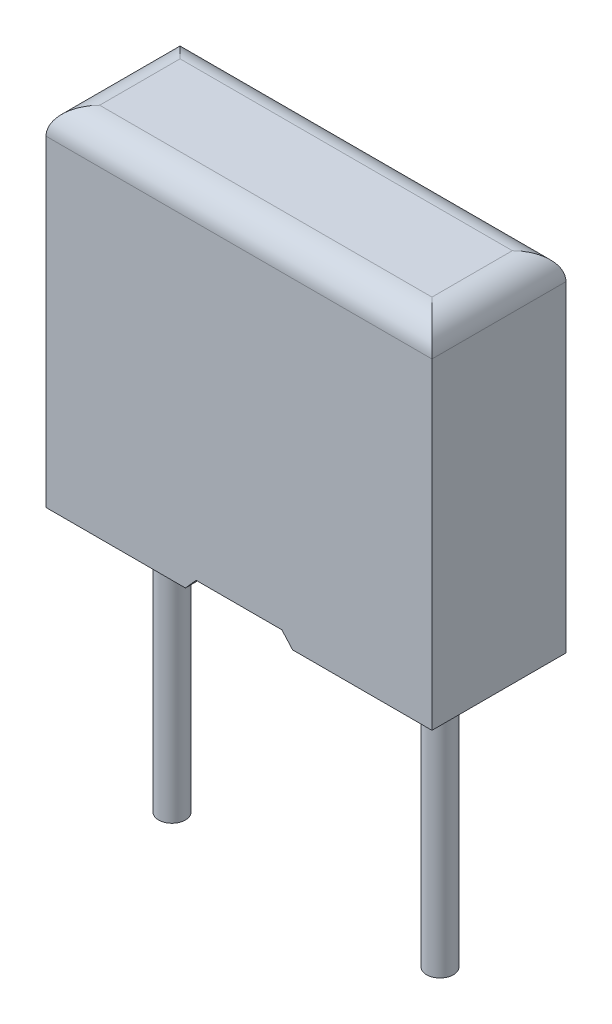
ISO-10303-21;
HEADER;
FILE_DESCRIPTION(('STEP AP214'),'2;1');
FILE_NAME('part.step','',(''),(''),'','','');
FILE_SCHEMA(('AUTOMOTIVE_DESIGN { 1 0 10303 214 1 1 1 1 }'));
ENDSEC;
DATA;
#1=APPLICATION_CONTEXT('core data for automotive mechanical design processes');
#2=APPLICATION_PROTOCOL_DEFINITION('international standard','automotive_design',2000,#1);
#3=PRODUCT_CONTEXT('',#1,'mechanical');
#4=PRODUCT('Part','Part','',(#3));
#5=PRODUCT_RELATED_PRODUCT_CATEGORY('part','',(#4));
#6=PRODUCT_DEFINITION_FORMATION('','',#4);
#7=PRODUCT_DEFINITION_CONTEXT('part definition',#1,'design');
#8=PRODUCT_DEFINITION('design','',#6,#7);
#9=PRODUCT_DEFINITION_SHAPE('','',#8);
#10=(LENGTH_UNIT() NAMED_UNIT(*) SI_UNIT(.MILLI.,.METRE.));
#11=(NAMED_UNIT(*) PLANE_ANGLE_UNIT() SI_UNIT($,.RADIAN.));
#12=(NAMED_UNIT(*) SI_UNIT($,.STERADIAN.) SOLID_ANGLE_UNIT());
#13=UNCERTAINTY_MEASURE_WITH_UNIT(LENGTH_MEASURE(1.E-05),#10,'distance_accuracy_value','');
#14=(GEOMETRIC_REPRESENTATION_CONTEXT(3) GLOBAL_UNCERTAINTY_ASSIGNED_CONTEXT((#13)) GLOBAL_UNIT_ASSIGNED_CONTEXT((#10,
#11,#12)) REPRESENTATION_CONTEXT('',''));
#15=CARTESIAN_POINT('',(0.,0.,0.));
#16=DIRECTION('',(0.,0.,1.));
#17=DIRECTION('',(1.,0.,0.));
#18=AXIS2_PLACEMENT_3D('',#15,#16,#17);
#19=CARTESIAN_POINT('',(6.1,-5.,1.25));
#20=DIRECTION('',(0.,1.,0.));
#21=DIRECTION('',(0.,0.,1.));
#22=AXIS2_PLACEMENT_3D('',#19,#20,#21);
#23=CYLINDRICAL_SURFACE('',#22,0.25);
#24=CARTESIAN_POINT('',(6.1,-5.,1.25));
#25=DIRECTION('',(0.,1.,0.));
#26=DIRECTION('',(0.,0.,-1.));
#27=AXIS2_PLACEMENT_3D('',#24,#25,#26);
#28=CIRCLE('',#27,0.25);
#29=CARTESIAN_POINT('',(6.1,-5.,1.));
#30=VERTEX_POINT('',#29);
#31=EDGE_CURVE('E11',#30,#30,#28,.T.);
#32=ORIENTED_EDGE('',*,*,#31,.T.);
#33=EDGE_LOOP('',(#32));
#34=FACE_BOUND('',#33,.T.);
#35=CARTESIAN_POINT('',(6.1,0.75,1.25));
#36=DIRECTION('',(0.,-1.,0.));
#37=DIRECTION('',(0.,0.,-1.));
#38=AXIS2_PLACEMENT_3D('',#35,#36,#37);
#39=CIRCLE('',#38,0.25);
#40=CARTESIAN_POINT('',(6.1,0.75,1.5));
#41=VERTEX_POINT('',#40);
#42=EDGE_CURVE('E28',#41,#41,#39,.T.);
#43=ORIENTED_EDGE('',*,*,#42,.T.);
#44=EDGE_LOOP('',(#43));
#45=FACE_BOUND('',#44,.T.);
#46=ADVANCED_FACE('F17',(#34,#45),#23,.T.);
#47=CARTESIAN_POINT('',(1.1,-5.,1.25));
#48=DIRECTION('',(0.,1.,0.));
#49=DIRECTION('',(0.,0.,1.));
#50=AXIS2_PLACEMENT_3D('',#47,#48,#49);
#51=CYLINDRICAL_SURFACE('',#50,0.25);
#52=CARTESIAN_POINT('',(1.1,-5.,1.25));
#53=DIRECTION('',(0.,-1.,0.));
#54=DIRECTION('',(0.,0.,-1.));
#55=AXIS2_PLACEMENT_3D('',#52,#53,#54);
#56=CIRCLE('',#55,0.25);
#57=CARTESIAN_POINT('',(1.1,-5.,1.5));
#58=VERTEX_POINT('',#57);
#59=EDGE_CURVE('E222',#58,#58,#56,.T.);
#60=ORIENTED_EDGE('',*,*,#59,.F.);
#61=EDGE_LOOP('',(#60));
#62=FACE_BOUND('',#61,.T.);
#63=CARTESIAN_POINT('',(1.1,0.75,1.25));
#64=DIRECTION('',(0.,-1.,0.));
#65=DIRECTION('',(0.,0.,-1.));
#66=AXIS2_PLACEMENT_3D('',#63,#64,#65);
#67=CIRCLE('',#66,0.25);
#68=CARTESIAN_POINT('',(1.1,0.75,1.5));
#69=VERTEX_POINT('',#68);
#70=EDGE_CURVE('E356',#69,#69,#67,.T.);
#71=ORIENTED_EDGE('',*,*,#70,.T.);
#72=EDGE_LOOP('',(#71));
#73=FACE_BOUND('',#72,.T.);
#74=ADVANCED_FACE('F881',(#62,#73),#51,.T.);
#75=CARTESIAN_POINT('',(0.,0.,2.5));
#76=DIRECTION('',(0.,1.,0.));
#77=DIRECTION('',(1.,0.,0.));
#78=AXIS2_PLACEMENT_3D('',#75,#76,#77);
#79=PLANE('',#78);
#80=DIRECTION('',(0.,0.,1.));
#81=VECTOR('',#80,1.);
#82=CARTESIAN_POINT('',(4.6,0.,0.));
#83=LINE('',#82,#81);
#84=CARTESIAN_POINT('',(4.6,0.,0.));
#85=VERTEX_POINT('',#84);
#86=CARTESIAN_POINT('',(4.6,0.,0.239999976));
#87=VERTEX_POINT('',#86);
#88=EDGE_CURVE('E208',#85,#87,#83,.T.);
#89=ORIENTED_EDGE('',*,*,#88,.F.);
#90=DIRECTION('',(1.,0.,0.));
#91=VECTOR('',#90,1.);
#92=CARTESIAN_POINT('',(0.,0.,0.));
#93=LINE('',#92,#91);
#94=CARTESIAN_POINT('',(7.2,0.,0.));
#95=VERTEX_POINT('',#94);
#96=EDGE_CURVE('E349',#85,#95,#93,.T.);
#97=ORIENTED_EDGE('',*,*,#96,.T.);
#98=DIRECTION('',(0.,0.,-1.));
#99=VECTOR('',#98,1.);
#100=CARTESIAN_POINT('',(7.2,0.,2.5));
#101=LINE('',#100,#99);
#102=CARTESIAN_POINT('',(7.2,0.,2.5));
#103=VERTEX_POINT('',#102);
#104=EDGE_CURVE('E280',#103,#95,#101,.T.);
#105=ORIENTED_EDGE('',*,*,#104,.F.);
#106=DIRECTION('',(1.,0.,0.));
#107=VECTOR('',#106,1.);
#108=CARTESIAN_POINT('',(0.,0.,2.5));
#109=LINE('',#108,#107);
#110=CARTESIAN_POINT('',(4.6,0.,2.5));
#111=VERTEX_POINT('',#110);
#112=EDGE_CURVE('E247',#111,#103,#109,.T.);
#113=ORIENTED_EDGE('',*,*,#112,.F.);
#114=DIRECTION('',(0.,0.,1.));
#115=VECTOR('',#114,1.);
#116=CARTESIAN_POINT('',(4.6,0.,0.));
#117=LINE('',#116,#115);
#118=CARTESIAN_POINT('',(4.6,0.,2.260000024));
#119=VERTEX_POINT('',#118);
#120=EDGE_CURVE('E251',#119,#111,#117,.T.);
#121=ORIENTED_EDGE('',*,*,#120,.F.);
#122=DIRECTION('',(-1.,0.,0.));
#123=VECTOR('',#122,1.);
#124=CARTESIAN_POINT('',(6.96000002399999,0.,2.260000024));
#125=LINE('',#124,#123);
#126=CARTESIAN_POINT('',(6.96000002399999,0.,2.260000024));
#127=VERTEX_POINT('',#126);
#128=EDGE_CURVE('E365',#127,#119,#125,.T.);
#129=ORIENTED_EDGE('',*,*,#128,.F.);
#130=DIRECTION('',(0.,0.,1.));
#131=VECTOR('',#130,1.);
#132=CARTESIAN_POINT('',(6.960000024,0.,0.239999976));
#133=LINE('',#132,#131);
#134=CARTESIAN_POINT('',(6.960000024,0.,0.239999976));
#135=VERTEX_POINT('',#134);
#136=EDGE_CURVE('E175',#135,#127,#133,.T.);
#137=ORIENTED_EDGE('',*,*,#136,.F.);
#138=DIRECTION('',(1.,0.,0.));
#139=VECTOR('',#138,1.);
#140=CARTESIAN_POINT('',(0.239999976,0.,0.239999976000001));
#141=LINE('',#140,#139);
#142=EDGE_CURVE('E266',#87,#135,#141,.T.);
#143=ORIENTED_EDGE('',*,*,#142,.F.);
#144=EDGE_LOOP('',(#89,#97,#105,#113,#121,#129,#137,#143));
#145=FACE_BOUND('',#144,.T.);
#146=ADVANCED_FACE('F434',(#145),#79,.F.);
#147=CARTESIAN_POINT('',(0.,0.,2.5));
#148=DIRECTION('',(0.,0.,-1.));
#149=DIRECTION('',(0.,-1.,0.));
#150=AXIS2_PLACEMENT_3D('',#147,#148,#149);
#151=PLANE('',#150);
#152=DIRECTION('',(0.,1.,0.));
#153=VECTOR('',#152,1.);
#154=CARTESIAN_POINT('',(7.2,0.,2.5));
#155=LINE('',#154,#153);
#156=CARTESIAN_POINT('',(7.2,6.,2.5));
#157=VERTEX_POINT('',#156);
#158=EDGE_CURVE('E357',#103,#157,#155,.T.);
#159=ORIENTED_EDGE('',*,*,#158,.T.);
#160=DIRECTION('',(-1.,0.,0.));
#161=VECTOR('',#160,1.);
#162=CARTESIAN_POINT('',(0.,6.,2.5));
#163=LINE('',#162,#161);
#164=CARTESIAN_POINT('',(0.,6.,2.5));
#165=VERTEX_POINT('',#164);
#166=EDGE_CURVE('E285',#157,#165,#163,.T.);
#167=ORIENTED_EDGE('',*,*,#166,.T.);
#168=DIRECTION('',(0.,-1.,0.));
#169=VECTOR('',#168,1.);
#170=CARTESIAN_POINT('',(0.,0.,2.5));
#171=LINE('',#170,#169);
#172=CARTESIAN_POINT('',(0.,0.,2.5));
#173=VERTEX_POINT('',#172);
#174=EDGE_CURVE('E281',#165,#173,#171,.T.);
#175=ORIENTED_EDGE('',*,*,#174,.T.);
#176=DIRECTION('',(1.,0.,0.));
#177=VECTOR('',#176,1.);
#178=CARTESIAN_POINT('',(0.,0.,2.5));
#179=LINE('',#178,#177);
#180=CARTESIAN_POINT('',(2.6,0.,2.5));
#181=VERTEX_POINT('',#180);
#182=EDGE_CURVE('E246',#173,#181,#179,.T.);
#183=ORIENTED_EDGE('',*,*,#182,.T.);
#184=DIRECTION('',(-0.665713474524011,-0.746207457639743,0.));
#185=VECTOR('',#184,1.);
#186=CARTESIAN_POINT('',(2.6,0.,2.5));
#187=LINE('',#186,#185);
#188=CARTESIAN_POINT('',(2.799944,0.22412,2.5));
#189=VERTEX_POINT('',#188);
#190=EDGE_CURVE('E275',#189,#181,#187,.T.);
#191=ORIENTED_EDGE('',*,*,#190,.F.);
#192=DIRECTION('',(-1.,0.,0.));
#193=VECTOR('',#192,1.);
#194=CARTESIAN_POINT('',(3.6,0.22412,2.5));
#195=LINE('',#194,#193);
#196=CARTESIAN_POINT('',(4.400056,0.22412,2.5));
#197=VERTEX_POINT('',#196);
#198=EDGE_CURVE('E218',#197,#189,#195,.T.);
#199=ORIENTED_EDGE('',*,*,#198,.F.);
#200=DIRECTION('',(0.665713474524011,-0.746207457639743,0.));
#201=VECTOR('',#200,1.);
#202=CARTESIAN_POINT('',(4.6,0.,2.5));
#203=LINE('',#202,#201);
#204=EDGE_CURVE('E242',#197,#111,#203,.T.);
#205=ORIENTED_EDGE('',*,*,#204,.T.);
#206=ORIENTED_EDGE('',*,*,#112,.T.);
#207=EDGE_LOOP('',(#159,#167,#175,#183,#191,#199,#205,#206));
#208=FACE_BOUND('',#207,.T.);
#209=ADVANCED_FACE('F438',(#208),#151,.F.);
#210=CARTESIAN_POINT('',(0.,0.,0.));
#211=DIRECTION('',(0.,0.,-1.));
#212=DIRECTION('',(0.,-1.,0.));
#213=AXIS2_PLACEMENT_3D('',#210,#211,#212);
#214=PLANE('',#213);
#215=DIRECTION('',(0.,-1.,0.));
#216=VECTOR('',#215,1.);
#217=CARTESIAN_POINT('',(0.,0.,0.));
#218=LINE('',#217,#216);
#219=CARTESIAN_POINT('',(0.,6.,0.));
#220=VERTEX_POINT('',#219);
#221=CARTESIAN_POINT('',(0.,0.,0.));
#222=VERTEX_POINT('',#221);
#223=EDGE_CURVE('E262',#220,#222,#218,.T.);
#224=ORIENTED_EDGE('',*,*,#223,.F.);
#225=DIRECTION('',(1.,0.,0.));
#226=VECTOR('',#225,1.);
#227=CARTESIAN_POINT('',(7.2,6.,0.));
#228=LINE('',#227,#226);
#229=CARTESIAN_POINT('',(7.2,6.,0.));
#230=VERTEX_POINT('',#229);
#231=EDGE_CURVE('E270',#220,#230,#228,.T.);
#232=ORIENTED_EDGE('',*,*,#231,.T.);
#233=DIRECTION('',(0.,1.,0.));
#234=VECTOR('',#233,1.);
#235=CARTESIAN_POINT('',(7.2,0.,0.));
#236=LINE('',#235,#234);
#237=EDGE_CURVE('E364',#95,#230,#236,.T.);
#238=ORIENTED_EDGE('',*,*,#237,.F.);
#239=ORIENTED_EDGE('',*,*,#96,.F.);
#240=DIRECTION('',(0.665713474524011,-0.746207457639743,0.));
#241=VECTOR('',#240,1.);
#242=CARTESIAN_POINT('',(4.6,0.,0.));
#243=LINE('',#242,#241);
#244=CARTESIAN_POINT('',(4.400056,0.22412,0.));
#245=VERTEX_POINT('',#244);
#246=EDGE_CURVE('E211',#245,#85,#243,.T.);
#247=ORIENTED_EDGE('',*,*,#246,.F.);
#248=DIRECTION('',(-1.,0.,0.));
#249=VECTOR('',#248,1.);
#250=CARTESIAN_POINT('',(3.6,0.22412,0.));
#251=LINE('',#250,#249);
#252=CARTESIAN_POINT('',(2.799944,0.22412,0.));
#253=VERTEX_POINT('',#252);
#254=EDGE_CURVE('E227',#245,#253,#251,.T.);
#255=ORIENTED_EDGE('',*,*,#254,.T.);
#256=DIRECTION('',(-0.665713474524011,-0.746207457639743,0.));
#257=VECTOR('',#256,1.);
#258=CARTESIAN_POINT('',(2.6,0.,0.));
#259=LINE('',#258,#257);
#260=CARTESIAN_POINT('',(2.6,0.,0.));
#261=VERTEX_POINT('',#260);
#262=EDGE_CURVE('E223',#253,#261,#259,.T.);
#263=ORIENTED_EDGE('',*,*,#262,.T.);
#264=DIRECTION('',(1.,0.,0.));
#265=VECTOR('',#264,1.);
#266=CARTESIAN_POINT('',(0.,0.,0.));
#267=LINE('',#266,#265);
#268=EDGE_CURVE('E216',#222,#261,#267,.T.);
#269=ORIENTED_EDGE('',*,*,#268,.F.);
#270=EDGE_LOOP('',(#224,#232,#238,#239,#247,#255,#263,#269));
#271=FACE_BOUND('',#270,.T.);
#272=ADVANCED_FACE('F483',(#271),#214,.T.);
#273=CARTESIAN_POINT('',(6.96000002399999,0.75,2.260000024));
#274=DIRECTION('',(0.,0.,1.));
#275=DIRECTION('',(1.,0.,0.));
#276=AXIS2_PLACEMENT_3D('',#273,#274,#275);
#277=PLANE('',#276);
#278=DIRECTION('',(0.665713474524011,-0.746207457639743,0.));
#279=VECTOR('',#278,1.);
#280=CARTESIAN_POINT('',(5.27332139631465,-0.754735282589323,2.260000024));
#281=LINE('',#280,#279);
#282=CARTESIAN_POINT('',(4.400056,0.22412,2.260000024));
#283=VERTEX_POINT('',#282);
#284=EDGE_CURVE('E332',#283,#119,#281,.T.);
#285=ORIENTED_EDGE('',*,*,#284,.F.);
#286=DIRECTION('',(-1.,0.,0.));
#287=VECTOR('',#286,1.);
#288=CARTESIAN_POINT('',(6.96000002399999,0.22412,2.260000024));
#289=LINE('',#288,#287);
#290=CARTESIAN_POINT('',(2.799944,0.22412,2.260000024));
#291=VERTEX_POINT('',#290);
#292=EDGE_CURVE('E228',#283,#291,#289,.T.);
#293=ORIENTED_EDGE('',*,*,#292,.T.);
#294=DIRECTION('',(-0.665713474524011,-0.746207457639743,0.));
#295=VECTOR('',#294,1.);
#296=CARTESIAN_POINT('',(4.90481079565194,2.58349435602724,2.260000024));
#297=LINE('',#296,#295);
#298=CARTESIAN_POINT('',(2.6,0.,2.260000024));
#299=VERTEX_POINT('',#298);
#300=EDGE_CURVE('E21',#291,#299,#297,.T.);
#301=ORIENTED_EDGE('',*,*,#300,.T.);
#302=DIRECTION('',(-1.,0.,0.));
#303=VECTOR('',#302,1.);
#304=CARTESIAN_POINT('',(6.96000002399999,0.,2.260000024));
#305=LINE('',#304,#303);
#306=CARTESIAN_POINT('',(0.239999976,0.,2.260000024));
#307=VERTEX_POINT('',#306);
#308=EDGE_CURVE('E178',#299,#307,#305,.T.);
#309=ORIENTED_EDGE('',*,*,#308,.T.);
#310=DIRECTION('',(0.,-1.,0.));
#311=VECTOR('',#310,1.);
#312=CARTESIAN_POINT('',(0.239999976,0.75,2.260000024));
#313=LINE('',#312,#311);
#314=CARTESIAN_POINT('',(0.239999976,0.75,2.260000024));
#315=VERTEX_POINT('',#314);
#316=EDGE_CURVE('E163',#315,#307,#313,.T.);
#317=ORIENTED_EDGE('',*,*,#316,.F.);
#318=DIRECTION('',(-1.,0.,0.));
#319=VECTOR('',#318,1.);
#320=CARTESIAN_POINT('',(6.96000002399999,0.75,2.260000024));
#321=LINE('',#320,#319);
#322=CARTESIAN_POINT('',(6.96000002399999,0.75,2.260000024));
#323=VERTEX_POINT('',#322);
#324=EDGE_CURVE('E292',#323,#315,#321,.T.);
#325=ORIENTED_EDGE('',*,*,#324,.F.);
#326=DIRECTION('',(0.,-1.,0.));
#327=VECTOR('',#326,1.);
#328=CARTESIAN_POINT('',(6.96000002399999,0.75,2.260000024));
#329=LINE('',#328,#327);
#330=EDGE_CURVE('E185',#323,#127,#329,.T.);
#331=ORIENTED_EDGE('',*,*,#330,.T.);
#332=ORIENTED_EDGE('',*,*,#128,.T.);
#333=EDGE_LOOP('',(#285,#293,#301,#309,#317,#325,#331,#332));
#334=FACE_BOUND('',#333,.T.);
#335=ADVANCED_FACE('F179',(#334),#277,.F.);
#336=CARTESIAN_POINT('',(0.239999976,0.75,0.239999976000001));
#337=DIRECTION('',(0.,0.,-1.));
#338=DIRECTION('',(-1.,0.,0.));
#339=AXIS2_PLACEMENT_3D('',#336,#337,#338);
#340=PLANE('',#339);
#341=DIRECTION('',(1.,0.,0.));
#342=VECTOR('',#341,1.);
#343=CARTESIAN_POINT('',(0.239999976,0.22412,0.239999976000001));
#344=LINE('',#343,#342);
#345=CARTESIAN_POINT('',(2.799944,0.22412,0.239999976));
#346=VERTEX_POINT('',#345);
#347=CARTESIAN_POINT('',(4.400056,0.22412,0.239999976));
#348=VERTEX_POINT('',#347);
#349=EDGE_CURVE('E369',#346,#348,#344,.T.);
#350=ORIENTED_EDGE('',*,*,#349,.T.);
#351=DIRECTION('',(-0.665713474524011,0.746207457639743,0.));
#352=VECTOR('',#351,1.);
#353=CARTESIAN_POINT('',(2.29518920434806,2.58349435602724,0.239999976));
#354=LINE('',#353,#352);
#355=EDGE_CURVE('E248',#87,#348,#354,.T.);
#356=ORIENTED_EDGE('',*,*,#355,.F.);
#357=ORIENTED_EDGE('',*,*,#142,.T.);
#358=DIRECTION('',(0.,-1.,0.));
#359=VECTOR('',#358,1.);
#360=CARTESIAN_POINT('',(6.960000024,0.75,0.239999976));
#361=LINE('',#360,#359);
#362=CARTESIAN_POINT('',(6.960000024,0.75,0.239999976));
#363=VERTEX_POINT('',#362);
#364=EDGE_CURVE('E301',#363,#135,#361,.T.);
#365=ORIENTED_EDGE('',*,*,#364,.F.);
#366=DIRECTION('',(1.,0.,0.));
#367=VECTOR('',#366,1.);
#368=CARTESIAN_POINT('',(0.239999976,0.75,0.239999976000001));
#369=LINE('',#368,#367);
#370=CARTESIAN_POINT('',(0.239999976,0.75,0.239999976000001));
#371=VERTEX_POINT('',#370);
#372=EDGE_CURVE('E252',#371,#363,#369,.T.);
#373=ORIENTED_EDGE('',*,*,#372,.F.);
#374=DIRECTION('',(0.,-1.,0.));
#375=VECTOR('',#374,1.);
#376=CARTESIAN_POINT('',(0.239999976,0.75,0.239999976000001));
#377=LINE('',#376,#375);
#378=CARTESIAN_POINT('',(0.239999976,0.,0.239999976000001));
#379=VERTEX_POINT('',#378);
#380=EDGE_CURVE('E263',#371,#379,#377,.T.);
#381=ORIENTED_EDGE('',*,*,#380,.T.);
#382=DIRECTION('',(1.,0.,0.));
#383=VECTOR('',#382,1.);
#384=CARTESIAN_POINT('',(0.239999976,0.,0.239999976000001));
#385=LINE('',#384,#383);
#386=CARTESIAN_POINT('',(2.6,0.,0.239999976));
#387=VERTEX_POINT('',#386);
#388=EDGE_CURVE('E191',#379,#387,#385,.T.);
#389=ORIENTED_EDGE('',*,*,#388,.T.);
#390=DIRECTION('',(0.665713474524011,0.746207457639743,0.));
#391=VECTOR('',#390,1.);
#392=CARTESIAN_POINT('',(1.92667860368534,-0.754735282589326,0.239999976));
#393=LINE('',#392,#391);
#394=EDGE_CURVE('E288',#387,#346,#393,.T.);
#395=ORIENTED_EDGE('',*,*,#394,.T.);
#396=EDGE_LOOP('',(#350,#356,#357,#365,#373,#381,#389,#395));
#397=FACE_BOUND('',#396,.T.);
#398=ADVANCED_FACE('F453',(#397),#340,.F.);
#399=CARTESIAN_POINT('',(0.,0.75,0.));
#400=DIRECTION('',(0.,-1.,0.));
#401=DIRECTION('',(0.,0.,-1.));
#402=AXIS2_PLACEMENT_3D('',#399,#400,#401);
#403=PLANE('',#402);
#404=DIRECTION('',(0.,0.,-1.));
#405=VECTOR('',#404,1.);
#406=CARTESIAN_POINT('',(0.239999976,0.75,2.260000024));
#407=LINE('',#406,#405);
#408=EDGE_CURVE('E170',#315,#371,#407,.T.);
#409=ORIENTED_EDGE('',*,*,#408,.T.);
#410=ORIENTED_EDGE('',*,*,#372,.T.);
#411=DIRECTION('',(0.,0.,1.));
#412=VECTOR('',#411,1.);
#413=CARTESIAN_POINT('',(6.960000024,0.75,0.239999976));
#414=LINE('',#413,#412);
#415=EDGE_CURVE('E256',#363,#323,#414,.T.);
#416=ORIENTED_EDGE('',*,*,#415,.T.);
#417=ORIENTED_EDGE('',*,*,#324,.T.);
#418=EDGE_LOOP('',(#409,#410,#416,#417));
#419=FACE_BOUND('',#418,.T.);
#420=ORIENTED_EDGE('',*,*,#42,.F.);
#421=EDGE_LOOP('',(#420));
#422=FACE_BOUND('',#421,.T.);
#423=ORIENTED_EDGE('',*,*,#70,.F.);
#424=EDGE_LOOP('',(#423));
#425=FACE_BOUND('',#424,.T.);
#426=ADVANCED_FACE('F455',(#419,#422,#425),#403,.T.);
#427=CARTESIAN_POINT('',(0.,0.,2.5));
#428=DIRECTION('',(0.,1.,0.));
#429=DIRECTION('',(1.,0.,0.));
#430=AXIS2_PLACEMENT_3D('',#427,#428,#429);
#431=PLANE('',#430);
#432=ORIENTED_EDGE('',*,*,#268,.T.);
#433=DIRECTION('',(0.,0.,1.));
#434=VECTOR('',#433,1.);
#435=CARTESIAN_POINT('',(2.6,0.,0.));
#436=LINE('',#435,#434);
#437=EDGE_CURVE('E213',#261,#387,#436,.T.);
#438=ORIENTED_EDGE('',*,*,#437,.T.);
#439=ORIENTED_EDGE('',*,*,#388,.F.);
#440=DIRECTION('',(0.,0.,-1.));
#441=VECTOR('',#440,1.);
#442=CARTESIAN_POINT('',(0.239999976,0.,2.260000024));
#443=LINE('',#442,#441);
#444=EDGE_CURVE('E168',#307,#379,#443,.T.);
#445=ORIENTED_EDGE('',*,*,#444,.F.);
#446=ORIENTED_EDGE('',*,*,#308,.F.);
#447=DIRECTION('',(0.,0.,1.));
#448=VECTOR('',#447,1.);
#449=CARTESIAN_POINT('',(2.6,0.,0.));
#450=LINE('',#449,#448);
#451=EDGE_CURVE('E217',#299,#181,#450,.T.);
#452=ORIENTED_EDGE('',*,*,#451,.T.);
#453=ORIENTED_EDGE('',*,*,#182,.F.);
#454=DIRECTION('',(0.,0.,-1.));
#455=VECTOR('',#454,1.);
#456=CARTESIAN_POINT('',(0.,0.,2.5));
#457=LINE('',#456,#455);
#458=EDGE_CURVE('E261',#173,#222,#457,.T.);
#459=ORIENTED_EDGE('',*,*,#458,.T.);
#460=EDGE_LOOP('',(#432,#438,#439,#445,#446,#452,#453,#459));
#461=FACE_BOUND('',#460,.T.);
#462=ADVANCED_FACE('F188',(#461),#431,.F.);
#463=CARTESIAN_POINT('',(0.,0.,2.5));
#464=DIRECTION('',(1.,0.,0.));
#465=DIRECTION('',(0.,1.,0.));
#466=AXIS2_PLACEMENT_3D('',#463,#464,#465);
#467=PLANE('',#466);
#468=ORIENTED_EDGE('',*,*,#174,.F.);
#469=DIRECTION('',(0.,0.,-1.));
#470=VECTOR('',#469,1.);
#471=CARTESIAN_POINT('',(0.,6.,2.5));
#472=LINE('',#471,#470);
#473=EDGE_CURVE('E257',#165,#220,#472,.T.);
#474=ORIENTED_EDGE('',*,*,#473,.T.);
#475=ORIENTED_EDGE('',*,*,#223,.T.);
#476=ORIENTED_EDGE('',*,*,#458,.F.);
#477=EDGE_LOOP('',(#468,#474,#475,#476));
#478=FACE_BOUND('',#477,.T.);
#479=ADVANCED_FACE('F501',(#478),#467,.F.);
#480=CARTESIAN_POINT('',(7.2,0.,2.5));
#481=DIRECTION('',(-1.,0.,0.));
#482=DIRECTION('',(0.,0.,1.));
#483=AXIS2_PLACEMENT_3D('',#480,#481,#482);
#484=PLANE('',#483);
#485=ORIENTED_EDGE('',*,*,#237,.T.);
#486=DIRECTION('',(0.,0.,1.));
#487=VECTOR('',#486,1.);
#488=CARTESIAN_POINT('',(7.2,6.,2.5));
#489=LINE('',#488,#487);
#490=EDGE_CURVE('E314',#230,#157,#489,.T.);
#491=ORIENTED_EDGE('',*,*,#490,.T.);
#492=ORIENTED_EDGE('',*,*,#158,.F.);
#493=ORIENTED_EDGE('',*,*,#104,.T.);
#494=EDGE_LOOP('',(#485,#491,#492,#493));
#495=FACE_BOUND('',#494,.T.);
#496=ADVANCED_FACE('F487',(#495),#484,.F.);
#497=CARTESIAN_POINT('',(0.,6.5,2.5));
#498=DIRECTION('',(0.,-1.,0.));
#499=DIRECTION('',(0.,0.,-1.));
#500=AXIS2_PLACEMENT_3D('',#497,#498,#499);
#501=PLANE('',#500);
#502=DIRECTION('',(-1.,0.,0.));
#503=VECTOR('',#502,1.);
#504=CARTESIAN_POINT('',(0.,6.5,0.5));
#505=LINE('',#504,#503);
#506=CARTESIAN_POINT('',(6.7,6.5,0.5));
#507=VERTEX_POINT('',#506);
#508=CARTESIAN_POINT('',(0.5,6.5,0.5));
#509=VERTEX_POINT('',#508);
#510=EDGE_CURVE('E276',#507,#509,#505,.T.);
#511=ORIENTED_EDGE('',*,*,#510,.T.);
#512=DIRECTION('',(0.,0.,1.));
#513=VECTOR('',#512,1.);
#514=CARTESIAN_POINT('',(0.5,6.5,2.5));
#515=LINE('',#514,#513);
#516=CARTESIAN_POINT('',(0.5,6.5,2.));
#517=VERTEX_POINT('',#516);
#518=EDGE_CURVE('E241',#509,#517,#515,.T.);
#519=ORIENTED_EDGE('',*,*,#518,.T.);
#520=DIRECTION('',(1.,0.,0.));
#521=VECTOR('',#520,1.);
#522=CARTESIAN_POINT('',(0.,6.5,2.));
#523=LINE('',#522,#521);
#524=CARTESIAN_POINT('',(6.7,6.5,2.));
#525=VERTEX_POINT('',#524);
#526=EDGE_CURVE('E202',#517,#525,#523,.T.);
#527=ORIENTED_EDGE('',*,*,#526,.T.);
#528=DIRECTION('',(0.,0.,-1.));
#529=VECTOR('',#528,1.);
#530=CARTESIAN_POINT('',(6.7,6.5,2.5));
#531=LINE('',#530,#529);
#532=EDGE_CURVE('E194',#525,#507,#531,.T.);
#533=ORIENTED_EDGE('',*,*,#532,.T.);
#534=EDGE_LOOP('',(#511,#519,#527,#533));
#535=FACE_BOUND('',#534,.T.);
#536=ADVANCED_FACE('F767',(#535),#501,.F.);
#537=CARTESIAN_POINT('',(0.239999976,0.75,2.260000024));
#538=DIRECTION('',(-1.,0.,0.));
#539=DIRECTION('',(0.,1.,0.));
#540=AXIS2_PLACEMENT_3D('',#537,#538,#539);
#541=PLANE('',#540);
#542=ORIENTED_EDGE('',*,*,#444,.T.);
#543=ORIENTED_EDGE('',*,*,#380,.F.);
#544=ORIENTED_EDGE('',*,*,#408,.F.);
#545=ORIENTED_EDGE('',*,*,#316,.T.);
#546=EDGE_LOOP('',(#542,#543,#544,#545));
#547=FACE_BOUND('',#546,.T.);
#548=ADVANCED_FACE('F165',(#547),#541,.F.);
#549=CARTESIAN_POINT('',(6.960000024,0.75,0.239999976));
#550=DIRECTION('',(1.,0.,0.));
#551=DIRECTION('',(0.,0.,1.));
#552=AXIS2_PLACEMENT_3D('',#549,#550,#551);
#553=PLANE('',#552);
#554=ORIENTED_EDGE('',*,*,#136,.T.);
#555=ORIENTED_EDGE('',*,*,#330,.F.);
#556=ORIENTED_EDGE('',*,*,#415,.F.);
#557=ORIENTED_EDGE('',*,*,#364,.T.);
#558=EDGE_LOOP('',(#554,#555,#556,#557));
#559=FACE_BOUND('',#558,.T.);
#560=ADVANCED_FACE('F450',(#559),#553,.F.);
#561=CARTESIAN_POINT('',(3.6,0.22412,0.));
#562=DIRECTION('',(0.,1.,0.));
#563=DIRECTION('',(1.,0.,0.));
#564=AXIS2_PLACEMENT_3D('',#561,#562,#563);
#565=PLANE('',#564);
#566=DIRECTION('',(0.,0.,1.));
#567=VECTOR('',#566,1.);
#568=CARTESIAN_POINT('',(2.799944,0.22412,0.));
#569=LINE('',#568,#567);
#570=EDGE_CURVE('E206',#253,#346,#569,.T.);
#571=ORIENTED_EDGE('',*,*,#570,.F.);
#572=ORIENTED_EDGE('',*,*,#254,.F.);
#573=DIRECTION('',(0.,0.,1.));
#574=VECTOR('',#573,1.);
#575=CARTESIAN_POINT('',(4.400056,0.22412,0.));
#576=LINE('',#575,#574);
#577=EDGE_CURVE('E297',#245,#348,#576,.T.);
#578=ORIENTED_EDGE('',*,*,#577,.T.);
#579=ORIENTED_EDGE('',*,*,#349,.F.);
#580=EDGE_LOOP('',(#571,#572,#578,#579));
#581=FACE_BOUND('',#580,.T.);
#582=ADVANCED_FACE('F723',(#581),#565,.F.);
#583=CARTESIAN_POINT('',(2.6,0.,0.));
#584=DIRECTION('',(-0.746207457639743,0.665713474524011,0.));
#585=DIRECTION('',(0.,0.,1.));
#586=AXIS2_PLACEMENT_3D('',#583,#584,#585);
#587=PLANE('',#586);
#588=ORIENTED_EDGE('',*,*,#437,.F.);
#589=ORIENTED_EDGE('',*,*,#262,.F.);
#590=ORIENTED_EDGE('',*,*,#570,.T.);
#591=ORIENTED_EDGE('',*,*,#394,.F.);
#592=EDGE_LOOP('',(#588,#589,#590,#591));
#593=FACE_BOUND('',#592,.T.);
#594=ADVANCED_FACE('F719',(#593),#587,.F.);
#595=CARTESIAN_POINT('',(2.6,0.,0.));
#596=DIRECTION('',(-0.746207457639743,0.665713474524011,0.));
#597=DIRECTION('',(0.,0.,1.));
#598=AXIS2_PLACEMENT_3D('',#595,#596,#597);
#599=PLANE('',#598);
#600=DIRECTION('',(0.,0.,1.));
#601=VECTOR('',#600,1.);
#602=CARTESIAN_POINT('',(2.799944,0.22412,0.));
#603=LINE('',#602,#601);
#604=EDGE_CURVE('E271',#291,#189,#603,.T.);
#605=ORIENTED_EDGE('',*,*,#604,.T.);
#606=ORIENTED_EDGE('',*,*,#190,.T.);
#607=ORIENTED_EDGE('',*,*,#451,.F.);
#608=ORIENTED_EDGE('',*,*,#300,.F.);
#609=EDGE_LOOP('',(#605,#606,#607,#608));
#610=FACE_BOUND('',#609,.T.);
#611=ADVANCED_FACE('F503',(#610),#599,.F.);
#612=CARTESIAN_POINT('',(3.6,0.22412,0.));
#613=DIRECTION('',(0.,1.,0.));
#614=DIRECTION('',(1.,0.,0.));
#615=AXIS2_PLACEMENT_3D('',#612,#613,#614);
#616=PLANE('',#615);
#617=ORIENTED_EDGE('',*,*,#292,.F.);
#618=DIRECTION('',(0.,0.,1.));
#619=VECTOR('',#618,1.);
#620=CARTESIAN_POINT('',(4.400056,0.22412,0.));
#621=LINE('',#620,#619);
#622=EDGE_CURVE('E221',#283,#197,#621,.T.);
#623=ORIENTED_EDGE('',*,*,#622,.T.);
#624=ORIENTED_EDGE('',*,*,#198,.T.);
#625=ORIENTED_EDGE('',*,*,#604,.F.);
#626=EDGE_LOOP('',(#617,#623,#624,#625));
#627=FACE_BOUND('',#626,.T.);
#628=ADVANCED_FACE('F445',(#627),#616,.F.);
#629=CARTESIAN_POINT('',(1.1,-5.,1.25));
#630=DIRECTION('',(0.,-1.,0.));
#631=DIRECTION('',(0.,0.,-1.));
#632=AXIS2_PLACEMENT_3D('',#629,#630,#631);
#633=PLANE('',#632);
#634=ORIENTED_EDGE('',*,*,#59,.T.);
#635=EDGE_LOOP('',(#634));
#636=FACE_BOUND('',#635,.T.);
#637=ADVANCED_FACE('F860',(#636),#633,.T.);
#638=CARTESIAN_POINT('',(4.6,0.,0.));
#639=DIRECTION('',(-0.746207457639743,-0.665713474524012,0.));
#640=DIRECTION('',(-0.665713474524012,0.746207457639743,0.));
#641=AXIS2_PLACEMENT_3D('',#638,#639,#640);
#642=PLANE('',#641);
#643=ORIENTED_EDGE('',*,*,#284,.T.);
#644=ORIENTED_EDGE('',*,*,#120,.T.);
#645=ORIENTED_EDGE('',*,*,#204,.F.);
#646=ORIENTED_EDGE('',*,*,#622,.F.);
#647=EDGE_LOOP('',(#643,#644,#645,#646));
#648=FACE_BOUND('',#647,.T.);
#649=ADVANCED_FACE('F430',(#648),#642,.T.);
#650=CARTESIAN_POINT('',(4.6,0.,0.));
#651=DIRECTION('',(-0.746207457639743,-0.665713474524012,0.));
#652=DIRECTION('',(-0.665713474524012,0.746207457639743,0.));
#653=AXIS2_PLACEMENT_3D('',#650,#651,#652);
#654=PLANE('',#653);
#655=ORIENTED_EDGE('',*,*,#355,.T.);
#656=ORIENTED_EDGE('',*,*,#577,.F.);
#657=ORIENTED_EDGE('',*,*,#246,.T.);
#658=ORIENTED_EDGE('',*,*,#88,.T.);
#659=EDGE_LOOP('',(#655,#656,#657,#658));
#660=FACE_BOUND('',#659,.T.);
#661=ADVANCED_FACE('F478',(#660),#654,.T.);
#662=CARTESIAN_POINT('',(6.1,-5.,1.25));
#663=DIRECTION('',(0.,-1.,0.));
#664=DIRECTION('',(0.,0.,-1.));
#665=AXIS2_PLACEMENT_3D('',#662,#663,#664);
#666=PLANE('',#665);
#667=ORIENTED_EDGE('',*,*,#31,.F.);
#668=EDGE_LOOP('',(#667));
#669=FACE_BOUND('',#668,.T.);
#670=ADVANCED_FACE('F746',(#669),#666,.T.);
#671=CARTESIAN_POINT('',(6.7,6.,2.5));
#672=DIRECTION('',(0.,0.,-1.));
#673=DIRECTION('',(-1.,0.,0.));
#674=AXIS2_PLACEMENT_3D('',#671,#672,#673);
#675=CYLINDRICAL_SURFACE('',#674,0.5);
#676=CARTESIAN_POINT('',(6.7,6.5,0.5));
#677=CARTESIAN_POINT('',(6.99289321881345,6.5,0.207106781186548));
#678=CARTESIAN_POINT('',(7.19999999999999,6.29289321881346,0.));
#679=CARTESIAN_POINT('',(7.2,6.,0.));
#680=(BOUNDED_CURVE() B_SPLINE_CURVE(3,(#676,#677,#678,#679),.UNSPECIFIED.,.F.,
.F.) B_SPLINE_CURVE_WITH_KNOTS((4,4),(4.71238898038469,6.28318530717959),
.UNSPECIFIED.) CURVE() GEOMETRIC_REPRESENTATION_ITEM() RATIONAL_B_SPLINE_CURVE((1.,
0.804737854124365,0.804737854124365,1.)) REPRESENTATION_ITEM(''));
#681=EDGE_CURVE('E234',#507,#230,#680,.T.);
#682=ORIENTED_EDGE('',*,*,#681,.F.);
#683=ORIENTED_EDGE('',*,*,#532,.F.);
#684=CARTESIAN_POINT('',(7.2,6.,2.5));
#685=CARTESIAN_POINT('',(7.19999999999999,6.29289321881346,2.5));
#686=CARTESIAN_POINT('',(6.99289321881345,6.5,2.29289321881345));
#687=CARTESIAN_POINT('',(6.7,6.5,2.));
#688=(BOUNDED_CURVE() B_SPLINE_CURVE(3,(#684,#685,#686,#687),.UNSPECIFIED.,.F.,
.F.) B_SPLINE_CURVE_WITH_KNOTS((4,4),(3.1415926535898,4.71238898038469),
.UNSPECIFIED.) CURVE() GEOMETRIC_REPRESENTATION_ITEM() RATIONAL_B_SPLINE_CURVE((1.,
0.804737854124365,0.804737854124365,1.)) REPRESENTATION_ITEM(''));
#689=EDGE_CURVE('E212',#157,#525,#688,.T.);
#690=ORIENTED_EDGE('',*,*,#689,.F.);
#691=ORIENTED_EDGE('',*,*,#490,.F.);
#692=EDGE_LOOP('',(#682,#683,#690,#691));
#693=FACE_BOUND('',#692,.T.);
#694=ADVANCED_FACE('F493',(#693),#675,.T.);
#695=CARTESIAN_POINT('',(0.,6.,2.));
#696=DIRECTION('',(-1.,0.,0.));
#697=DIRECTION('',(0.,0.,1.));
#698=AXIS2_PLACEMENT_3D('',#695,#696,#697);
#699=CYLINDRICAL_SURFACE('',#698,0.5);
#700=ORIENTED_EDGE('',*,*,#689,.T.);
#701=ORIENTED_EDGE('',*,*,#526,.F.);
#702=CARTESIAN_POINT('',(0.,6.,2.5));
#703=CARTESIAN_POINT('',(0.,6.29289321881346,2.5));
#704=CARTESIAN_POINT('',(0.207106781186547,6.5,2.29289321881345));
#705=CARTESIAN_POINT('',(0.5,6.5,2.));
#706=(BOUNDED_CURVE() B_SPLINE_CURVE(3,(#702,#703,#704,#705),.UNSPECIFIED.,.F.,
.F.) B_SPLINE_CURVE_WITH_KNOTS((4,4),(0.,1.5707963267949),
.UNSPECIFIED.) CURVE() GEOMETRIC_REPRESENTATION_ITEM() RATIONAL_B_SPLINE_CURVE((1.,
0.804737854124365,0.804737854124365,1.)) REPRESENTATION_ITEM(''));
#707=EDGE_CURVE('E308',#165,#517,#706,.T.);
#708=ORIENTED_EDGE('',*,*,#707,.F.);
#709=ORIENTED_EDGE('',*,*,#166,.F.);
#710=EDGE_LOOP('',(#700,#701,#708,#709));
#711=FACE_BOUND('',#710,.T.);
#712=ADVANCED_FACE('F19',(#711),#699,.T.);
#713=CARTESIAN_POINT('',(0.,6.,0.5));
#714=DIRECTION('',(1.,0.,0.));
#715=DIRECTION('',(0.,0.,-1.));
#716=AXIS2_PLACEMENT_3D('',#713,#714,#715);
#717=CYLINDRICAL_SURFACE('',#716,0.5);
#718=ORIENTED_EDGE('',*,*,#681,.T.);
#719=ORIENTED_EDGE('',*,*,#231,.F.);
#720=CARTESIAN_POINT('',(0.5,6.5,0.5));
#721=CARTESIAN_POINT('',(0.207106781186547,6.5,0.207106781186547));
#722=CARTESIAN_POINT('',(0.,6.29289321881345,0.));
#723=CARTESIAN_POINT('',(0.,6.,0.));
#724=(BOUNDED_CURVE() B_SPLINE_CURVE(3,(#720,#721,#722,#723),.UNSPECIFIED.,.F.,
.F.) B_SPLINE_CURVE_WITH_KNOTS((4,4),(1.5707963267949,3.1415926535898),
.UNSPECIFIED.) CURVE() GEOMETRIC_REPRESENTATION_ITEM() RATIONAL_B_SPLINE_CURVE((1.,
0.804737854124365,0.804737854124365,1.)) REPRESENTATION_ITEM(''));
#725=EDGE_CURVE('E302',#509,#220,#724,.T.);
#726=ORIENTED_EDGE('',*,*,#725,.F.);
#727=ORIENTED_EDGE('',*,*,#510,.F.);
#728=EDGE_LOOP('',(#718,#719,#726,#727));
#729=FACE_BOUND('',#728,.T.);
#730=ADVANCED_FACE('F690',(#729),#717,.T.);
#731=CARTESIAN_POINT('',(0.5,6.,2.5));
#732=DIRECTION('',(0.,0.,-1.));
#733=DIRECTION('',(-1.,0.,0.));
#734=AXIS2_PLACEMENT_3D('',#731,#732,#733);
#735=CYLINDRICAL_SURFACE('',#734,0.5);
#736=ORIENTED_EDGE('',*,*,#707,.T.);
#737=ORIENTED_EDGE('',*,*,#518,.F.);
#738=ORIENTED_EDGE('',*,*,#725,.T.);
#739=ORIENTED_EDGE('',*,*,#473,.F.);
#740=EDGE_LOOP('',(#736,#737,#738,#739));
#741=FACE_BOUND('',#740,.T.);
#742=ADVANCED_FACE('F496',(#741),#735,.T.);
#743=CLOSED_SHELL('',(#46,#74,#146,#209,#272,#335,#398,#426,#462,#479,#496,#536,#548,#560,#582,
#594,#611,#628,#637,#649,#661,#670,#694,#712,#730,#742));
#744=MANIFOLD_SOLID_BREP('B1',#743);
#745=ADVANCED_BREP_SHAPE_REPRESENTATION('',(#18,#744),#14);
#746=SHAPE_DEFINITION_REPRESENTATION(#9,#745);
ENDSEC;
END-ISO-10303-21;
